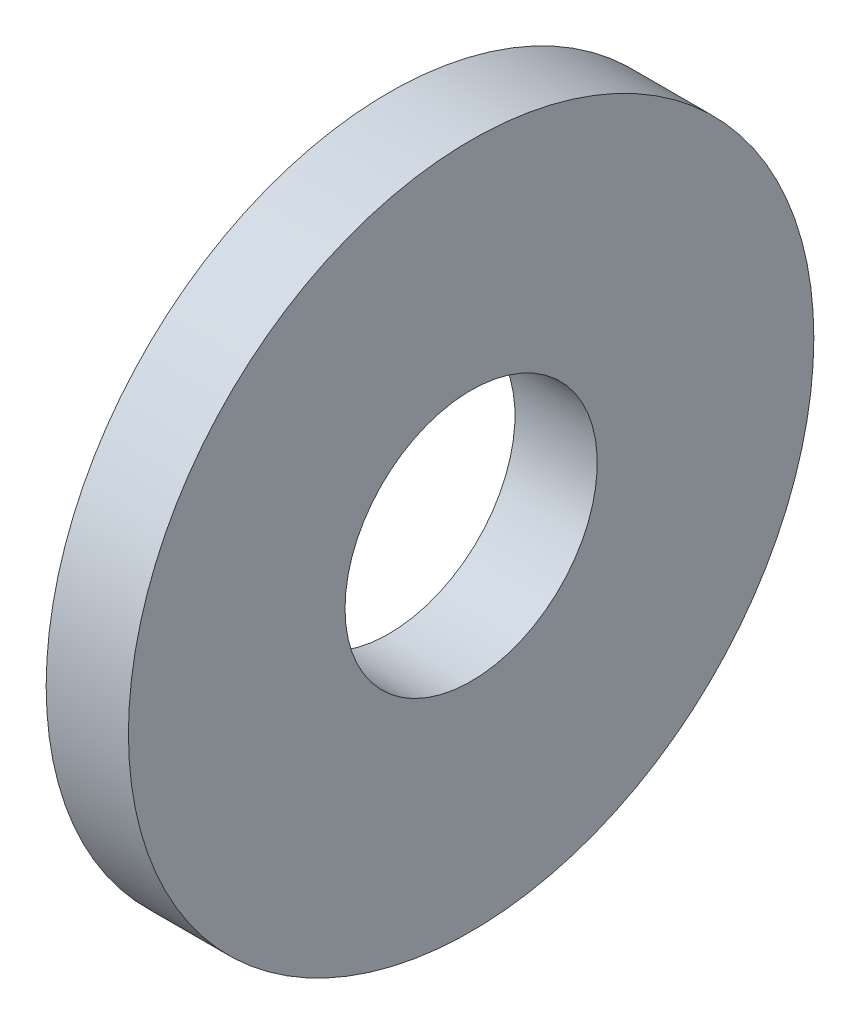
ISO-10303-21;
HEADER;
FILE_DESCRIPTION(('STEP AP214'),'2;1');
FILE_NAME('part.step','',(''),(''),'','','');
FILE_SCHEMA(('AUTOMOTIVE_DESIGN { 1 0 10303 214 1 1 1 1 }'));
ENDSEC;
DATA;
#1=APPLICATION_CONTEXT('core data for automotive mechanical design processes');
#2=APPLICATION_PROTOCOL_DEFINITION('international standard','automotive_design',2000,#1);
#3=PRODUCT_CONTEXT('',#1,'mechanical');
#4=PRODUCT('Part','Part','',(#3));
#5=PRODUCT_RELATED_PRODUCT_CATEGORY('part','',(#4));
#6=PRODUCT_DEFINITION_FORMATION('','',#4);
#7=PRODUCT_DEFINITION_CONTEXT('part definition',#1,'design');
#8=PRODUCT_DEFINITION('design','',#6,#7);
#9=PRODUCT_DEFINITION_SHAPE('','',#8);
#10=(LENGTH_UNIT() NAMED_UNIT(*) SI_UNIT(.MILLI.,.METRE.));
#11=(NAMED_UNIT(*) PLANE_ANGLE_UNIT() SI_UNIT($,.RADIAN.));
#12=(NAMED_UNIT(*) SI_UNIT($,.STERADIAN.) SOLID_ANGLE_UNIT());
#13=UNCERTAINTY_MEASURE_WITH_UNIT(LENGTH_MEASURE(1.E-05),#10,'distance_accuracy_value','');
#14=(GEOMETRIC_REPRESENTATION_CONTEXT(3) GLOBAL_UNCERTAINTY_ASSIGNED_CONTEXT((#13)) GLOBAL_UNIT_ASSIGNED_CONTEXT((#10,
#11,#12)) REPRESENTATION_CONTEXT('',''));
#15=CARTESIAN_POINT('',(0.,0.,0.));
#16=DIRECTION('',(0.,0.,1.));
#17=DIRECTION('',(1.,0.,0.));
#18=AXIS2_PLACEMENT_3D('',#15,#16,#17);
#19=CARTESIAN_POINT('',(-34.9249999999999,0.,0.));
#20=DIRECTION('',(-1.,0.,0.));
#21=DIRECTION('',(0.,0.,1.));
#22=AXIS2_PLACEMENT_3D('',#19,#20,#21);
#23=CYLINDRICAL_SURFACE('',#22,1.84);
#24=CARTESIAN_POINT('',(0.,0.,0.));
#25=DIRECTION('',(-1.,0.,0.));
#26=DIRECTION('',(0.,0.,1.));
#27=AXIS2_PLACEMENT_3D('',#24,#25,#26);
#28=CIRCLE('',#27,1.84);
#29=CARTESIAN_POINT('',(0.,0.,1.84));
#30=VERTEX_POINT('',#29);
#31=EDGE_CURVE('E10',#30,#30,#28,.T.);
#32=ORIENTED_EDGE('',*,*,#31,.F.);
#33=EDGE_LOOP('',(#32));
#34=FACE_BOUND('',#33,.T.);
#35=CARTESIAN_POINT('',(-1.2,0.,0.));
#36=DIRECTION('',(-1.,0.,0.));
#37=DIRECTION('',(0.,0.,1.));
#38=AXIS2_PLACEMENT_3D('',#35,#36,#37);
#39=CIRCLE('',#38,1.84);
#40=CARTESIAN_POINT('',(-1.2,0.,1.84));
#41=VERTEX_POINT('',#40);
#42=EDGE_CURVE('E43',#41,#41,#39,.T.);
#43=ORIENTED_EDGE('',*,*,#42,.T.);
#44=EDGE_LOOP('',(#43));
#45=FACE_BOUND('',#44,.T.);
#46=ADVANCED_FACE('F29',(#34,#45),#23,.F.);
#47=CARTESIAN_POINT('',(0.,1.84,0.));
#48=DIRECTION('',(-1.,0.,0.));
#49=DIRECTION('',(0.,0.,1.));
#50=AXIS2_PLACEMENT_3D('',#47,#48,#49);
#51=PLANE('',#50);
#52=CARTESIAN_POINT('',(0.,0.,0.));
#53=DIRECTION('',(-1.,0.,0.));
#54=DIRECTION('',(0.,0.,1.));
#55=AXIS2_PLACEMENT_3D('',#52,#53,#54);
#56=CIRCLE('',#55,5.);
#57=CARTESIAN_POINT('',(0.,0.,5.));
#58=VERTEX_POINT('',#57);
#59=EDGE_CURVE('E35',#58,#58,#56,.T.);
#60=ORIENTED_EDGE('',*,*,#59,.F.);
#61=EDGE_LOOP('',(#60));
#62=FACE_BOUND('',#61,.T.);
#63=ORIENTED_EDGE('',*,*,#31,.T.);
#64=EDGE_LOOP('',(#63));
#65=FACE_BOUND('',#64,.T.);
#66=ADVANCED_FACE('F58',(#62,#65),#51,.F.);
#67=CARTESIAN_POINT('',(-34.9249999999999,0.,0.));
#68=DIRECTION('',(-1.,0.,0.));
#69=DIRECTION('',(0.,0.,1.));
#70=AXIS2_PLACEMENT_3D('',#67,#68,#69);
#71=CYLINDRICAL_SURFACE('',#70,5.);
#72=CARTESIAN_POINT('',(-1.2,0.,0.));
#73=DIRECTION('',(-1.,0.,0.));
#74=DIRECTION('',(0.,0.,1.));
#75=AXIS2_PLACEMENT_3D('',#72,#73,#74);
#76=CIRCLE('',#75,5.);
#77=CARTESIAN_POINT('',(-1.2,0.,5.));
#78=VERTEX_POINT('',#77);
#79=EDGE_CURVE('E39',#78,#78,#76,.T.);
#80=ORIENTED_EDGE('',*,*,#79,.F.);
#81=EDGE_LOOP('',(#80));
#82=FACE_BOUND('',#81,.T.);
#83=ORIENTED_EDGE('',*,*,#59,.T.);
#84=EDGE_LOOP('',(#83));
#85=FACE_BOUND('',#84,.T.);
#86=ADVANCED_FACE('F53',(#82,#85),#71,.T.);
#87=CARTESIAN_POINT('',(-1.2,5.,0.));
#88=DIRECTION('',(1.,0.,0.));
#89=DIRECTION('',(0.,0.,-1.));
#90=AXIS2_PLACEMENT_3D('',#87,#88,#89);
#91=PLANE('',#90);
#92=ORIENTED_EDGE('',*,*,#42,.F.);
#93=EDGE_LOOP('',(#92));
#94=FACE_BOUND('',#93,.T.);
#95=ORIENTED_EDGE('',*,*,#79,.T.);
#96=EDGE_LOOP('',(#95));
#97=FACE_BOUND('',#96,.T.);
#98=ADVANCED_FACE('F50',(#94,#97),#91,.F.);
#99=CLOSED_SHELL('',(#46,#66,#86,#98));
#100=MANIFOLD_SOLID_BREP('B2',#99);
#101=ADVANCED_BREP_SHAPE_REPRESENTATION('',(#18,#100),#14);
#102=SHAPE_DEFINITION_REPRESENTATION(#9,#101);
ENDSEC;
END-ISO-10303-21;
